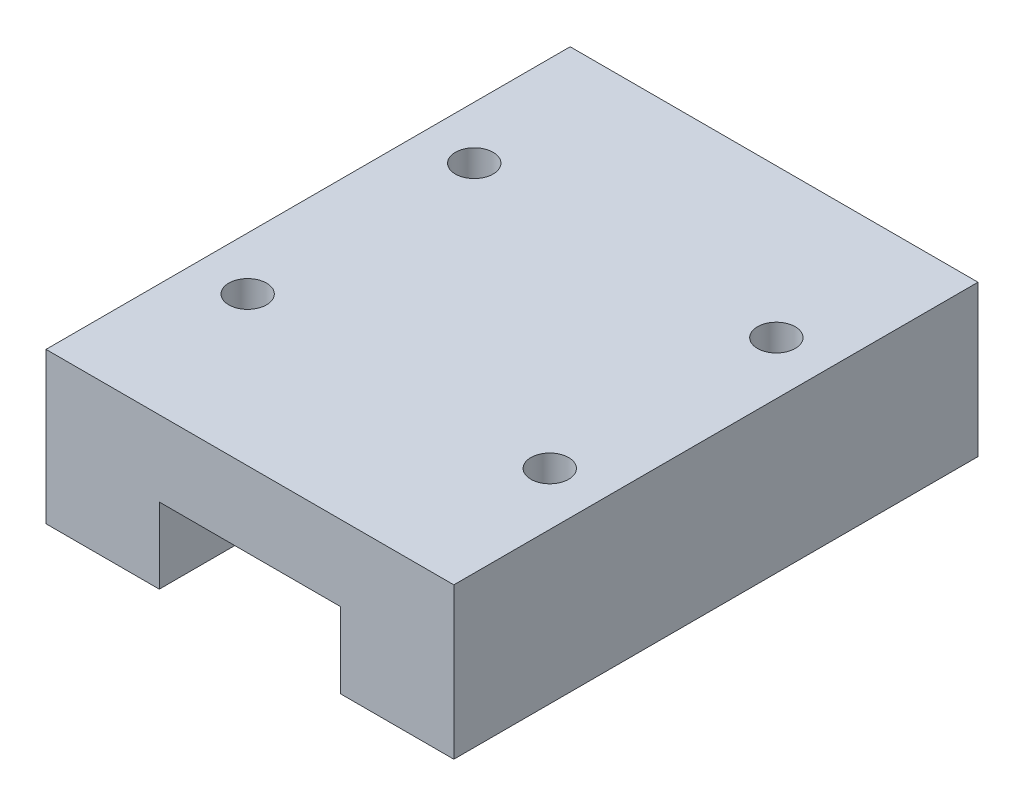
ISO-10303-21;
HEADER;
FILE_DESCRIPTION(('STEP AP214'),'2;1');
FILE_NAME('part.step','',(''),(''),'','','');
FILE_SCHEMA(('AUTOMOTIVE_DESIGN { 1 0 10303 214 1 1 1 1 }'));
ENDSEC;
DATA;
#1=APPLICATION_CONTEXT('core data for automotive mechanical design processes');
#2=APPLICATION_PROTOCOL_DEFINITION('international standard','automotive_design',2000,#1);
#3=PRODUCT_CONTEXT('',#1,'mechanical');
#4=PRODUCT('Part','Part','',(#3));
#5=PRODUCT_RELATED_PRODUCT_CATEGORY('part','',(#4));
#6=PRODUCT_DEFINITION_FORMATION('','',#4);
#7=PRODUCT_DEFINITION_CONTEXT('part definition',#1,'design');
#8=PRODUCT_DEFINITION('design','',#6,#7);
#9=PRODUCT_DEFINITION_SHAPE('','',#8);
#10=(LENGTH_UNIT() NAMED_UNIT(*) SI_UNIT(.MILLI.,.METRE.));
#11=(NAMED_UNIT(*) PLANE_ANGLE_UNIT() SI_UNIT($,.RADIAN.));
#12=(NAMED_UNIT(*) SI_UNIT($,.STERADIAN.) SOLID_ANGLE_UNIT());
#13=UNCERTAINTY_MEASURE_WITH_UNIT(LENGTH_MEASURE(1.E-05),#10,'distance_accuracy_value','');
#14=(GEOMETRIC_REPRESENTATION_CONTEXT(3) GLOBAL_UNCERTAINTY_ASSIGNED_CONTEXT((#13)) GLOBAL_UNIT_ASSIGNED_CONTEXT((#10,
#11,#12)) REPRESENTATION_CONTEXT('',''));
#15=CARTESIAN_POINT('',(0.,0.,0.));
#16=DIRECTION('',(0.,0.,1.));
#17=DIRECTION('',(1.,0.,0.));
#18=AXIS2_PLACEMENT_3D('',#15,#16,#17);
#19=CARTESIAN_POINT('',(7.5,0.,34.7));
#20=DIRECTION('',(0.,1.,0.));
#21=DIRECTION('',(-1.,0.,0.));
#22=AXIS2_PLACEMENT_3D('',#19,#20,#21);
#23=PLANE('',#22);
#24=DIRECTION('',(1.,0.,0.));
#25=VECTOR('',#24,1.);
#26=CARTESIAN_POINT('',(7.5,0.,0.));
#27=LINE('',#26,#25);
#28=CARTESIAN_POINT('',(0.,0.,0.));
#29=VERTEX_POINT('',#28);
#30=CARTESIAN_POINT('',(7.5,0.,0.));
#31=VERTEX_POINT('',#30);
#32=EDGE_CURVE('E148',#29,#31,#27,.T.);
#33=ORIENTED_EDGE('',*,*,#32,.T.);
#34=DIRECTION('',(0.,0.,-1.));
#35=VECTOR('',#34,1.);
#36=CARTESIAN_POINT('',(7.5,0.,34.7));
#37=LINE('',#36,#35);
#38=CARTESIAN_POINT('',(7.5,0.,34.7));
#39=VERTEX_POINT('',#38);
#40=EDGE_CURVE('E11',#39,#31,#37,.T.);
#41=ORIENTED_EDGE('',*,*,#40,.F.);
#42=DIRECTION('',(1.,0.,0.));
#43=VECTOR('',#42,1.);
#44=CARTESIAN_POINT('',(7.5,0.,34.7));
#45=LINE('',#44,#43);
#46=CARTESIAN_POINT('',(0.,0.,34.7));
#47=VERTEX_POINT('',#46);
#48=EDGE_CURVE('E170',#47,#39,#45,.T.);
#49=ORIENTED_EDGE('',*,*,#48,.F.);
#50=DIRECTION('',(0.,0.,-1.));
#51=VECTOR('',#50,1.);
#52=CARTESIAN_POINT('',(0.,0.,34.7));
#53=LINE('',#52,#51);
#54=EDGE_CURVE('E144',#47,#29,#53,.T.);
#55=ORIENTED_EDGE('',*,*,#54,.T.);
#56=EDGE_LOOP('',(#33,#41,#49,#55));
#57=FACE_BOUND('',#56,.T.);
#58=ADVANCED_FACE('F42',(#57),#23,.F.);
#59=CARTESIAN_POINT('',(7.5,5.,34.7));
#60=DIRECTION('',(-1.,0.,0.));
#61=DIRECTION('',(0.,-1.,0.));
#62=AXIS2_PLACEMENT_3D('',#59,#60,#61);
#63=PLANE('',#62);
#64=DIRECTION('',(0.,1.,0.));
#65=VECTOR('',#64,1.);
#66=CARTESIAN_POINT('',(7.5,5.,0.));
#67=LINE('',#66,#65);
#68=CARTESIAN_POINT('',(7.5,5.,0.));
#69=VERTEX_POINT('',#68);
#70=EDGE_CURVE('E152',#31,#69,#67,.T.);
#71=ORIENTED_EDGE('',*,*,#70,.T.);
#72=DIRECTION('',(0.,0.,-1.));
#73=VECTOR('',#72,1.);
#74=CARTESIAN_POINT('',(7.5,5.,34.7));
#75=LINE('',#74,#73);
#76=CARTESIAN_POINT('',(7.5,5.,34.7));
#77=VERTEX_POINT('',#76);
#78=EDGE_CURVE('E51',#77,#69,#75,.T.);
#79=ORIENTED_EDGE('',*,*,#78,.F.);
#80=DIRECTION('',(0.,1.,0.));
#81=VECTOR('',#80,1.);
#82=CARTESIAN_POINT('',(7.5,5.,34.7));
#83=LINE('',#82,#81);
#84=EDGE_CURVE('E103',#39,#77,#83,.T.);
#85=ORIENTED_EDGE('',*,*,#84,.F.);
#86=ORIENTED_EDGE('',*,*,#40,.T.);
#87=EDGE_LOOP('',(#71,#79,#85,#86));
#88=FACE_BOUND('',#87,.T.);
#89=ADVANCED_FACE('F274',(#88),#63,.F.);
#90=CARTESIAN_POINT('',(19.5,5.,34.7));
#91=DIRECTION('',(0.,1.,0.));
#92=DIRECTION('',(-1.,0.,0.));
#93=AXIS2_PLACEMENT_3D('',#90,#91,#92);
#94=PLANE('',#93);
#95=DIRECTION('',(1.,0.,0.));
#96=VECTOR('',#95,1.);
#97=CARTESIAN_POINT('',(19.5,5.,0.));
#98=LINE('',#97,#96);
#99=CARTESIAN_POINT('',(19.5,5.,0.));
#100=VERTEX_POINT('',#99);
#101=EDGE_CURVE('E155',#69,#100,#98,.T.);
#102=ORIENTED_EDGE('',*,*,#101,.T.);
#103=DIRECTION('',(0.,0.,-1.));
#104=VECTOR('',#103,1.);
#105=CARTESIAN_POINT('',(19.5,5.,34.7));
#106=LINE('',#105,#104);
#107=CARTESIAN_POINT('',(19.5,5.,34.7));
#108=VERTEX_POINT('',#107);
#109=EDGE_CURVE('E180',#108,#100,#106,.T.);
#110=ORIENTED_EDGE('',*,*,#109,.F.);
#111=DIRECTION('',(1.,0.,0.));
#112=VECTOR('',#111,1.);
#113=CARTESIAN_POINT('',(19.5,5.,34.7));
#114=LINE('',#113,#112);
#115=EDGE_CURVE('E191',#77,#108,#114,.T.);
#116=ORIENTED_EDGE('',*,*,#115,.F.);
#117=ORIENTED_EDGE('',*,*,#78,.T.);
#118=EDGE_LOOP('',(#102,#110,#116,#117));
#119=FACE_BOUND('',#118,.T.);
#120=ADVANCED_FACE('F189',(#119),#94,.F.);
#121=CARTESIAN_POINT('',(19.5,0.,34.7));
#122=DIRECTION('',(1.,0.,0.));
#123=DIRECTION('',(0.,0.,-1.));
#124=AXIS2_PLACEMENT_3D('',#121,#122,#123);
#125=PLANE('',#124);
#126=DIRECTION('',(0.,-1.,0.));
#127=VECTOR('',#126,1.);
#128=CARTESIAN_POINT('',(19.5,0.,0.));
#129=LINE('',#128,#127);
#130=CARTESIAN_POINT('',(19.5,0.,0.));
#131=VERTEX_POINT('',#130);
#132=EDGE_CURVE('E158',#100,#131,#129,.T.);
#133=ORIENTED_EDGE('',*,*,#132,.T.);
#134=DIRECTION('',(0.,0.,-1.));
#135=VECTOR('',#134,1.);
#136=CARTESIAN_POINT('',(19.5,0.,34.7));
#137=LINE('',#136,#135);
#138=CARTESIAN_POINT('',(19.5,0.,34.7));
#139=VERTEX_POINT('',#138);
#140=EDGE_CURVE('E176',#139,#131,#137,.T.);
#141=ORIENTED_EDGE('',*,*,#140,.F.);
#142=DIRECTION('',(0.,-1.,0.));
#143=VECTOR('',#142,1.);
#144=CARTESIAN_POINT('',(19.5,0.,34.7));
#145=LINE('',#144,#143);
#146=EDGE_CURVE('E204',#108,#139,#145,.T.);
#147=ORIENTED_EDGE('',*,*,#146,.F.);
#148=ORIENTED_EDGE('',*,*,#109,.T.);
#149=EDGE_LOOP('',(#133,#141,#147,#148));
#150=FACE_BOUND('',#149,.T.);
#151=ADVANCED_FACE('F199',(#150),#125,.F.);
#152=CARTESIAN_POINT('',(27.,0.,34.7));
#153=DIRECTION('',(0.,1.,0.));
#154=DIRECTION('',(-1.,0.,0.));
#155=AXIS2_PLACEMENT_3D('',#152,#153,#154);
#156=PLANE('',#155);
#157=DIRECTION('',(1.,0.,0.));
#158=VECTOR('',#157,1.);
#159=CARTESIAN_POINT('',(27.,0.,0.));
#160=LINE('',#159,#158);
#161=CARTESIAN_POINT('',(27.,0.,0.));
#162=VERTEX_POINT('',#161);
#163=EDGE_CURVE('E161',#131,#162,#160,.T.);
#164=ORIENTED_EDGE('',*,*,#163,.T.);
#165=DIRECTION('',(0.,0.,-1.));
#166=VECTOR('',#165,1.);
#167=CARTESIAN_POINT('',(27.,0.,34.7));
#168=LINE('',#167,#166);
#169=CARTESIAN_POINT('',(27.,0.,34.7));
#170=VERTEX_POINT('',#169);
#171=EDGE_CURVE('E135',#170,#162,#168,.T.);
#172=ORIENTED_EDGE('',*,*,#171,.F.);
#173=DIRECTION('',(1.,0.,0.));
#174=VECTOR('',#173,1.);
#175=CARTESIAN_POINT('',(27.,0.,34.7));
#176=LINE('',#175,#174);
#177=EDGE_CURVE('E124',#139,#170,#176,.T.);
#178=ORIENTED_EDGE('',*,*,#177,.F.);
#179=ORIENTED_EDGE('',*,*,#140,.T.);
#180=EDGE_LOOP('',(#164,#172,#178,#179));
#181=FACE_BOUND('',#180,.T.);
#182=ADVANCED_FACE('F202',(#181),#156,.F.);
#183=CARTESIAN_POINT('',(27.,10.,34.7));
#184=DIRECTION('',(-1.,0.,0.));
#185=DIRECTION('',(0.,0.,1.));
#186=AXIS2_PLACEMENT_3D('',#183,#184,#185);
#187=PLANE('',#186);
#188=DIRECTION('',(0.,1.,0.));
#189=VECTOR('',#188,1.);
#190=CARTESIAN_POINT('',(27.,10.,0.));
#191=LINE('',#190,#189);
#192=CARTESIAN_POINT('',(27.,10.,0.));
#193=VERTEX_POINT('',#192);
#194=EDGE_CURVE('E133',#162,#193,#191,.T.);
#195=ORIENTED_EDGE('',*,*,#194,.T.);
#196=DIRECTION('',(0.,0.,-1.));
#197=VECTOR('',#196,1.);
#198=CARTESIAN_POINT('',(27.,10.,34.7));
#199=LINE('',#198,#197);
#200=CARTESIAN_POINT('',(27.,10.,34.7));
#201=VERTEX_POINT('',#200);
#202=EDGE_CURVE('E130',#201,#193,#199,.T.);
#203=ORIENTED_EDGE('',*,*,#202,.F.);
#204=DIRECTION('',(0.,1.,0.));
#205=VECTOR('',#204,1.);
#206=CARTESIAN_POINT('',(27.,10.,34.7));
#207=LINE('',#206,#205);
#208=EDGE_CURVE('E118',#170,#201,#207,.T.);
#209=ORIENTED_EDGE('',*,*,#208,.F.);
#210=ORIENTED_EDGE('',*,*,#171,.T.);
#211=EDGE_LOOP('',(#195,#203,#209,#210));
#212=FACE_BOUND('',#211,.T.);
#213=ADVANCED_FACE('F131',(#212),#187,.F.);
#214=CARTESIAN_POINT('',(0.,10.,34.7));
#215=DIRECTION('',(0.,-1.,0.));
#216=DIRECTION('',(1.,0.,0.));
#217=AXIS2_PLACEMENT_3D('',#214,#215,#216);
#218=PLANE('',#217);
#219=CARTESIAN_POINT('',(3.5,10.,9.85));
#220=DIRECTION('',(0.,1.,0.));
#221=DIRECTION('',(0.,0.,1.));
#222=AXIS2_PLACEMENT_3D('',#219,#220,#221);
#223=CIRCLE('',#222,1.24999999999999);
#224=CARTESIAN_POINT('',(3.5,10.,11.1));
#225=VERTEX_POINT('',#224);
#226=EDGE_CURVE('E241',#225,#225,#223,.T.);
#227=ORIENTED_EDGE('',*,*,#226,.F.);
#228=EDGE_LOOP('',(#227));
#229=FACE_BOUND('',#228,.T.);
#230=CARTESIAN_POINT('',(3.50000000000001,10.,24.85));
#231=DIRECTION('',(0.,1.,0.));
#232=DIRECTION('',(0.,0.,1.));
#233=AXIS2_PLACEMENT_3D('',#230,#231,#232);
#234=CIRCLE('',#233,1.24999999999999);
#235=CARTESIAN_POINT('',(3.50000000000001,10.,26.1));
#236=VERTEX_POINT('',#235);
#237=EDGE_CURVE('E233',#236,#236,#234,.T.);
#238=ORIENTED_EDGE('',*,*,#237,.F.);
#239=EDGE_LOOP('',(#238));
#240=FACE_BOUND('',#239,.T.);
#241=CARTESIAN_POINT('',(23.5,10.,24.85));
#242=DIRECTION('',(0.,1.,0.));
#243=DIRECTION('',(0.,0.,1.));
#244=AXIS2_PLACEMENT_3D('',#241,#242,#243);
#245=CIRCLE('',#244,1.24999999999999);
#246=CARTESIAN_POINT('',(23.5,10.,26.1));
#247=VERTEX_POINT('',#246);
#248=EDGE_CURVE('E225',#247,#247,#245,.T.);
#249=ORIENTED_EDGE('',*,*,#248,.F.);
#250=EDGE_LOOP('',(#249));
#251=FACE_BOUND('',#250,.T.);
#252=CARTESIAN_POINT('',(23.5,10.,9.85));
#253=DIRECTION('',(0.,1.,0.));
#254=DIRECTION('',(0.,0.,1.));
#255=AXIS2_PLACEMENT_3D('',#252,#253,#254);
#256=CIRCLE('',#255,1.24999999999999);
#257=CARTESIAN_POINT('',(23.5,10.,11.1));
#258=VERTEX_POINT('',#257);
#259=EDGE_CURVE('E217',#258,#258,#256,.T.);
#260=ORIENTED_EDGE('',*,*,#259,.F.);
#261=EDGE_LOOP('',(#260));
#262=FACE_BOUND('',#261,.T.);
#263=DIRECTION('',(-1.,0.,0.));
#264=VECTOR('',#263,1.);
#265=CARTESIAN_POINT('',(0.,10.,0.));
#266=LINE('',#265,#264);
#267=CARTESIAN_POINT('',(0.,10.,0.));
#268=VERTEX_POINT('',#267);
#269=EDGE_CURVE('E89',#193,#268,#266,.T.);
#270=ORIENTED_EDGE('',*,*,#269,.T.);
#271=DIRECTION('',(0.,0.,-1.));
#272=VECTOR('',#271,1.);
#273=CARTESIAN_POINT('',(0.,10.,34.7));
#274=LINE('',#273,#272);
#275=CARTESIAN_POINT('',(0.,10.,34.7));
#276=VERTEX_POINT('',#275);
#277=EDGE_CURVE('E136',#276,#268,#274,.T.);
#278=ORIENTED_EDGE('',*,*,#277,.F.);
#279=DIRECTION('',(-1.,0.,0.));
#280=VECTOR('',#279,1.);
#281=CARTESIAN_POINT('',(0.,10.,34.7));
#282=LINE('',#281,#280);
#283=EDGE_CURVE('E122',#201,#276,#282,.T.);
#284=ORIENTED_EDGE('',*,*,#283,.F.);
#285=ORIENTED_EDGE('',*,*,#202,.T.);
#286=EDGE_LOOP('',(#270,#278,#284,#285));
#287=FACE_BOUND('',#286,.T.);
#288=ADVANCED_FACE('F138',(#229,#240,#251,#262,#287),#218,.F.);
#289=CARTESIAN_POINT('',(0.,0.,34.7));
#290=DIRECTION('',(1.,0.,0.));
#291=DIRECTION('',(0.,0.,-1.));
#292=AXIS2_PLACEMENT_3D('',#289,#290,#291);
#293=PLANE('',#292);
#294=DIRECTION('',(0.,-1.,0.));
#295=VECTOR('',#294,1.);
#296=CARTESIAN_POINT('',(0.,0.,0.));
#297=LINE('',#296,#295);
#298=EDGE_CURVE('E95',#268,#29,#297,.T.);
#299=ORIENTED_EDGE('',*,*,#298,.T.);
#300=ORIENTED_EDGE('',*,*,#54,.F.);
#301=DIRECTION('',(0.,-1.,0.));
#302=VECTOR('',#301,1.);
#303=CARTESIAN_POINT('',(0.,0.,34.7));
#304=LINE('',#303,#302);
#305=EDGE_CURVE('E59',#276,#47,#304,.T.);
#306=ORIENTED_EDGE('',*,*,#305,.F.);
#307=ORIENTED_EDGE('',*,*,#277,.T.);
#308=EDGE_LOOP('',(#299,#300,#306,#307));
#309=FACE_BOUND('',#308,.T.);
#310=ADVANCED_FACE('F249',(#309),#293,.F.);
#311=CARTESIAN_POINT('',(0.,0.,34.7));
#312=DIRECTION('',(0.,0.,-1.));
#313=DIRECTION('',(-1.,0.,0.));
#314=AXIS2_PLACEMENT_3D('',#311,#312,#313);
#315=PLANE('',#314);
#316=ORIENTED_EDGE('',*,*,#48,.T.);
#317=ORIENTED_EDGE('',*,*,#84,.T.);
#318=ORIENTED_EDGE('',*,*,#115,.T.);
#319=ORIENTED_EDGE('',*,*,#146,.T.);
#320=ORIENTED_EDGE('',*,*,#177,.T.);
#321=ORIENTED_EDGE('',*,*,#208,.T.);
#322=ORIENTED_EDGE('',*,*,#283,.T.);
#323=ORIENTED_EDGE('',*,*,#305,.T.);
#324=EDGE_LOOP('',(#316,#317,#318,#319,#320,#321,#322,#323));
#325=FACE_BOUND('',#324,.T.);
#326=ADVANCED_FACE('F120',(#325),#315,.F.);
#327=CARTESIAN_POINT('',(0.,0.,0.));
#328=DIRECTION('',(0.,0.,-1.));
#329=DIRECTION('',(-1.,0.,0.));
#330=AXIS2_PLACEMENT_3D('',#327,#328,#329);
#331=PLANE('',#330);
#332=ORIENTED_EDGE('',*,*,#32,.F.);
#333=ORIENTED_EDGE('',*,*,#298,.F.);
#334=ORIENTED_EDGE('',*,*,#269,.F.);
#335=ORIENTED_EDGE('',*,*,#194,.F.);
#336=ORIENTED_EDGE('',*,*,#163,.F.);
#337=ORIENTED_EDGE('',*,*,#132,.F.);
#338=ORIENTED_EDGE('',*,*,#101,.F.);
#339=ORIENTED_EDGE('',*,*,#70,.F.);
#340=EDGE_LOOP('',(#332,#333,#334,#335,#336,#337,#338,#339));
#341=FACE_BOUND('',#340,.T.);
#342=ADVANCED_FACE('F195',(#341),#331,.T.);
#343=CARTESIAN_POINT('',(23.5,4.,9.85));
#344=DIRECTION('',(0.,1.,0.));
#345=DIRECTION('',(0.,0.,1.));
#346=AXIS2_PLACEMENT_3D('',#343,#344,#345);
#347=CONICAL_SURFACE('',#346,1.25,1.02974425867665);
#348=CARTESIAN_POINT('',(23.5,3.24892422621555,9.85));
#349=VERTEX_POINT('',#348);
#350=VERTEX_LOOP('',#349);
#351=FACE_BOUND('',#350,.T.);
#352=CARTESIAN_POINT('',(23.5,4.,9.85));
#353=DIRECTION('',(0.,1.,0.));
#354=DIRECTION('',(0.,0.,1.));
#355=AXIS2_PLACEMENT_3D('',#352,#353,#354);
#356=CIRCLE('',#355,1.25);
#357=CARTESIAN_POINT('',(23.5,4.,11.1));
#358=VERTEX_POINT('',#357);
#359=EDGE_CURVE('E153',#358,#358,#356,.T.);
#360=ORIENTED_EDGE('',*,*,#359,.T.);
#361=EDGE_LOOP('',(#360));
#362=FACE_BOUND('',#361,.T.);
#363=ADVANCED_FACE('F260',(#351,#362),#347,.F.);
#364=CARTESIAN_POINT('',(23.5,10.,9.85));
#365=DIRECTION('',(0.,1.,0.));
#366=DIRECTION('',(0.,0.,1.));
#367=AXIS2_PLACEMENT_3D('',#364,#365,#366);
#368=CYLINDRICAL_SURFACE('',#367,1.24999999999999);
#369=ORIENTED_EDGE('',*,*,#359,.F.);
#370=EDGE_LOOP('',(#369));
#371=FACE_BOUND('',#370,.T.);
#372=ORIENTED_EDGE('',*,*,#259,.T.);
#373=EDGE_LOOP('',(#372));
#374=FACE_BOUND('',#373,.T.);
#375=ADVANCED_FACE('F257',(#371,#374),#368,.F.);
#376=CARTESIAN_POINT('',(23.5,4.,24.85));
#377=DIRECTION('',(0.,1.,0.));
#378=DIRECTION('',(0.,0.,1.));
#379=AXIS2_PLACEMENT_3D('',#376,#377,#378);
#380=CONICAL_SURFACE('',#379,1.25,1.02974425867665);
#381=CARTESIAN_POINT('',(23.5,3.24892422621555,24.85));
#382=VERTEX_POINT('',#381);
#383=VERTEX_LOOP('',#382);
#384=FACE_BOUND('',#383,.T.);
#385=CARTESIAN_POINT('',(23.5,4.,24.85));
#386=DIRECTION('',(0.,1.,0.));
#387=DIRECTION('',(0.,0.,1.));
#388=AXIS2_PLACEMENT_3D('',#385,#386,#387);
#389=CIRCLE('',#388,1.25);
#390=CARTESIAN_POINT('',(23.5,4.,26.1));
#391=VERTEX_POINT('',#390);
#392=EDGE_CURVE('E221',#391,#391,#389,.T.);
#393=ORIENTED_EDGE('',*,*,#392,.T.);
#394=EDGE_LOOP('',(#393));
#395=FACE_BOUND('',#394,.T.);
#396=ADVANCED_FACE('F259',(#384,#395),#380,.F.);
#397=CARTESIAN_POINT('',(23.5,10.,24.85));
#398=DIRECTION('',(0.,1.,0.));
#399=DIRECTION('',(0.,0.,1.));
#400=AXIS2_PLACEMENT_3D('',#397,#398,#399);
#401=CYLINDRICAL_SURFACE('',#400,1.24999999999999);
#402=ORIENTED_EDGE('',*,*,#392,.F.);
#403=EDGE_LOOP('',(#402));
#404=FACE_BOUND('',#403,.T.);
#405=ORIENTED_EDGE('',*,*,#248,.T.);
#406=EDGE_LOOP('',(#405));
#407=FACE_BOUND('',#406,.T.);
#408=ADVANCED_FACE('F267',(#404,#407),#401,.F.);
#409=CARTESIAN_POINT('',(3.50000000000001,4.,24.85));
#410=DIRECTION('',(0.,1.,0.));
#411=DIRECTION('',(0.,0.,1.));
#412=AXIS2_PLACEMENT_3D('',#409,#410,#411);
#413=CONICAL_SURFACE('',#412,1.25,1.02974425867665);
#414=CARTESIAN_POINT('',(3.50000000000001,3.24892422621555,24.85));
#415=VERTEX_POINT('',#414);
#416=VERTEX_LOOP('',#415);
#417=FACE_BOUND('',#416,.T.);
#418=CARTESIAN_POINT('',(3.50000000000001,4.,24.85));
#419=DIRECTION('',(0.,1.,0.));
#420=DIRECTION('',(0.,0.,1.));
#421=AXIS2_PLACEMENT_3D('',#418,#419,#420);
#422=CIRCLE('',#421,1.25);
#423=CARTESIAN_POINT('',(3.50000000000001,4.,26.1));
#424=VERTEX_POINT('',#423);
#425=EDGE_CURVE('E229',#424,#424,#422,.T.);
#426=ORIENTED_EDGE('',*,*,#425,.T.);
#427=EDGE_LOOP('',(#426));
#428=FACE_BOUND('',#427,.T.);
#429=ADVANCED_FACE('F348',(#417,#428),#413,.F.);
#430=CARTESIAN_POINT('',(3.50000000000001,10.,24.85));
#431=DIRECTION('',(0.,1.,0.));
#432=DIRECTION('',(0.,0.,1.));
#433=AXIS2_PLACEMENT_3D('',#430,#431,#432);
#434=CYLINDRICAL_SURFACE('',#433,1.24999999999999);
#435=ORIENTED_EDGE('',*,*,#425,.F.);
#436=EDGE_LOOP('',(#435));
#437=FACE_BOUND('',#436,.T.);
#438=ORIENTED_EDGE('',*,*,#237,.T.);
#439=EDGE_LOOP('',(#438));
#440=FACE_BOUND('',#439,.T.);
#441=ADVANCED_FACE('F358',(#437,#440),#434,.F.);
#442=CARTESIAN_POINT('',(3.5,4.,9.85));
#443=DIRECTION('',(0.,1.,0.));
#444=DIRECTION('',(0.,0.,1.));
#445=AXIS2_PLACEMENT_3D('',#442,#443,#444);
#446=CONICAL_SURFACE('',#445,1.25,1.02974425867665);
#447=CARTESIAN_POINT('',(3.5,3.24892422621555,9.85));
#448=VERTEX_POINT('',#447);
#449=VERTEX_LOOP('',#448);
#450=FACE_BOUND('',#449,.T.);
#451=CARTESIAN_POINT('',(3.5,4.,9.85));
#452=DIRECTION('',(0.,1.,0.));
#453=DIRECTION('',(0.,0.,1.));
#454=AXIS2_PLACEMENT_3D('',#451,#452,#453);
#455=CIRCLE('',#454,1.25);
#456=CARTESIAN_POINT('',(3.5,4.,11.1));
#457=VERTEX_POINT('',#456);
#458=EDGE_CURVE('E237',#457,#457,#455,.T.);
#459=ORIENTED_EDGE('',*,*,#458,.T.);
#460=EDGE_LOOP('',(#459));
#461=FACE_BOUND('',#460,.T.);
#462=ADVANCED_FACE('F367',(#450,#461),#446,.F.);
#463=CARTESIAN_POINT('',(3.5,10.,9.85));
#464=DIRECTION('',(0.,1.,0.));
#465=DIRECTION('',(0.,0.,1.));
#466=AXIS2_PLACEMENT_3D('',#463,#464,#465);
#467=CYLINDRICAL_SURFACE('',#466,1.24999999999999);
#468=ORIENTED_EDGE('',*,*,#458,.F.);
#469=EDGE_LOOP('',(#468));
#470=FACE_BOUND('',#469,.T.);
#471=ORIENTED_EDGE('',*,*,#226,.T.);
#472=EDGE_LOOP('',(#471));
#473=FACE_BOUND('',#472,.T.);
#474=ADVANCED_FACE('F245',(#470,#473),#467,.F.);
#475=CLOSED_SHELL('',(#58,#89,#120,#151,#182,#213,#288,#310,#326,#342,#363,#375,#396,#408,#429,
#441,#462,#474));
#476=MANIFOLD_SOLID_BREP('B2',#475);
#477=ADVANCED_BREP_SHAPE_REPRESENTATION('',(#18,#476),#14);
#478=SHAPE_DEFINITION_REPRESENTATION(#9,#477);
ENDSEC;
END-ISO-10303-21;
